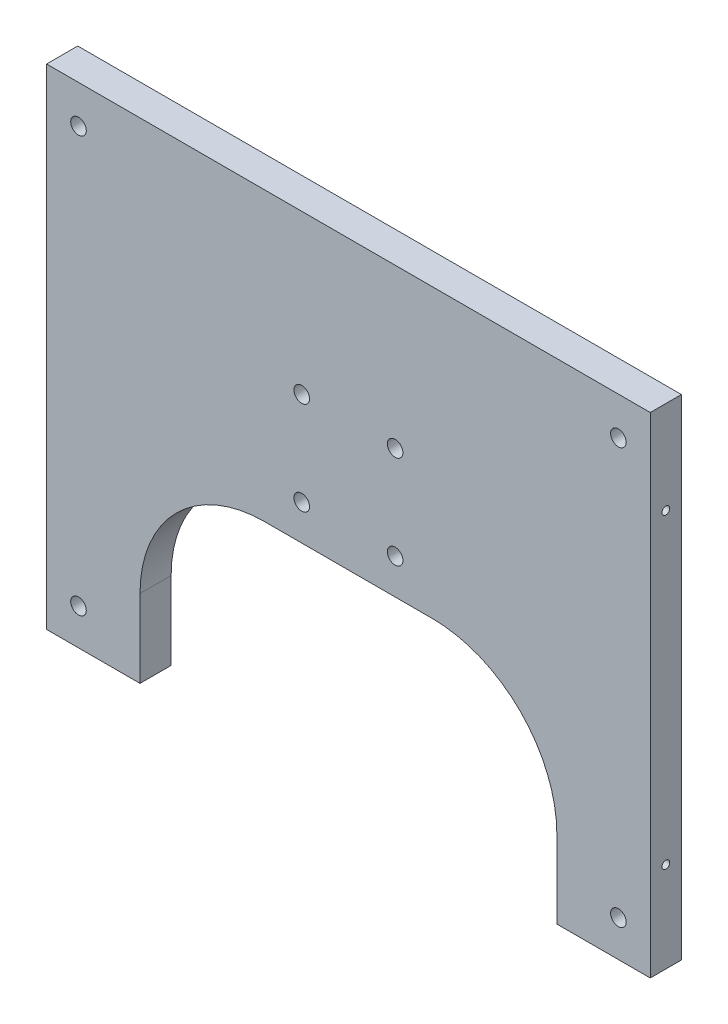
ISO-10303-21;
HEADER;
FILE_DESCRIPTION(('STEP AP214'),'2;1');
FILE_NAME('part.step','',(''),(''),'','','');
FILE_SCHEMA(('AUTOMOTIVE_DESIGN { 1 0 10303 214 1 1 1 1 }'));
ENDSEC;
DATA;
#1=APPLICATION_CONTEXT('core data for automotive mechanical design processes');
#2=APPLICATION_PROTOCOL_DEFINITION('international standard','automotive_design',2000,#1);
#3=PRODUCT_CONTEXT('',#1,'mechanical');
#4=PRODUCT('Part','Part','',(#3));
#5=PRODUCT_RELATED_PRODUCT_CATEGORY('part','',(#4));
#6=PRODUCT_DEFINITION_FORMATION('','',#4);
#7=PRODUCT_DEFINITION_CONTEXT('part definition',#1,'design');
#8=PRODUCT_DEFINITION('design','',#6,#7);
#9=PRODUCT_DEFINITION_SHAPE('','',#8);
#10=(LENGTH_UNIT() NAMED_UNIT(*) SI_UNIT(.MILLI.,.METRE.));
#11=(NAMED_UNIT(*) PLANE_ANGLE_UNIT() SI_UNIT($,.RADIAN.));
#12=(NAMED_UNIT(*) SI_UNIT($,.STERADIAN.) SOLID_ANGLE_UNIT());
#13=UNCERTAINTY_MEASURE_WITH_UNIT(LENGTH_MEASURE(1.E-05),#10,'distance_accuracy_value','');
#14=(GEOMETRIC_REPRESENTATION_CONTEXT(3) GLOBAL_UNCERTAINTY_ASSIGNED_CONTEXT((#13)) GLOBAL_UNIT_ASSIGNED_CONTEXT((#10,
#11,#12)) REPRESENTATION_CONTEXT('',''));
#15=CARTESIAN_POINT('',(0.,0.,0.));
#16=DIRECTION('',(0.,0.,1.));
#17=DIRECTION('',(1.,0.,0.));
#18=AXIS2_PLACEMENT_3D('',#15,#16,#17);
#19=CARTESIAN_POINT('',(12.6999999999998,10.7138543348653,-12.7000000000005));
#20=DIRECTION('',(-1.,0.,0.));
#21=DIRECTION('',(0.,-1.,0.));
#22=AXIS2_PLACEMENT_3D('',#19,#20,#21);
#23=PLANE('',#22);
#24=CARTESIAN_POINT('',(12.6999999999998,-152.193459623223,-6.34999999999336));
#25=DIRECTION('',(-1.,0.,0.));
#26=DIRECTION('',(0.,-1.,0.));
#27=AXIS2_PLACEMENT_3D('',#24,#25,#26);
#28=CIRCLE('',#27,1.58749999999999);
#29=CARTESIAN_POINT('',(12.6999999999998,-153.780959623223,-6.34999999999336));
#30=VERTEX_POINT('',#29);
#31=EDGE_CURVE('E145',#30,#30,#28,.T.);
#32=ORIENTED_EDGE('',*,*,#31,.F.);
#33=EDGE_LOOP('',(#32));
#34=FACE_BOUND('',#33,.T.);
#35=CARTESIAN_POINT('',(12.6999999999998,-27.084945239972,-6.34999999999364));
#36=DIRECTION('',(-1.,0.,0.));
#37=DIRECTION('',(0.,-1.,0.));
#38=AXIS2_PLACEMENT_3D('',#35,#36,#37);
#39=CIRCLE('',#38,1.5875);
#40=CARTESIAN_POINT('',(12.6999999999998,-28.672445239972,-6.34999999999364));
#41=VERTEX_POINT('',#40);
#42=EDGE_CURVE('E149',#41,#41,#39,.T.);
#43=ORIENTED_EDGE('',*,*,#42,.F.);
#44=EDGE_LOOP('',(#43));
#45=FACE_BOUND('',#44,.T.);
#46=DIRECTION('',(0.,-1.,0.));
#47=VECTOR('',#46,1.);
#48=CARTESIAN_POINT('',(12.6999999999995,10.713854334865,-3.33066907387547E-13));
#49=LINE('',#48,#47);
#50=CARTESIAN_POINT('',(12.6999999999995,10.713854334865,-3.33066907387547E-13));
#51=VERTEX_POINT('',#50);
#52=CARTESIAN_POINT('',(12.6999999999996,-189.051843155404,-3.88578058618805E-13));
#53=VERTEX_POINT('',#52);
#54=EDGE_CURVE('E198',#51,#53,#49,.T.);
#55=ORIENTED_EDGE('',*,*,#54,.F.);
#56=DIRECTION('',(0.,0.,1.));
#57=VECTOR('',#56,1.);
#58=CARTESIAN_POINT('',(12.6999999999998,10.7138543348653,-12.7000000000005));
#59=LINE('',#58,#57);
#60=CARTESIAN_POINT('',(12.6999999999998,10.7138543348653,-12.7000000000005));
#61=VERTEX_POINT('',#60);
#62=EDGE_CURVE('E244',#61,#51,#59,.T.);
#63=ORIENTED_EDGE('',*,*,#62,.F.);
#64=DIRECTION('',(0.,-1.,0.));
#65=VECTOR('',#64,1.);
#66=CARTESIAN_POINT('',(12.6999999999998,10.7138543348653,-12.7000000000005));
#67=LINE('',#66,#65);
#68=CARTESIAN_POINT('',(12.6999999999995,-189.051843155405,-12.7000000000003));
#69=VERTEX_POINT('',#68);
#70=EDGE_CURVE('E199',#61,#69,#67,.T.);
#71=ORIENTED_EDGE('',*,*,#70,.T.);
#72=DIRECTION('',(0.,0.,1.));
#73=VECTOR('',#72,1.);
#74=CARTESIAN_POINT('',(12.6999999999995,-189.051843155405,-12.7000000000003));
#75=LINE('',#74,#73);
#76=EDGE_CURVE('E222',#69,#53,#75,.T.);
#77=ORIENTED_EDGE('',*,*,#76,.T.);
#78=EDGE_LOOP('',(#55,#63,#71,#77));
#79=FACE_BOUND('',#78,.T.);
#80=ADVANCED_FACE('F36',(#34,#45,#79),#23,.T.);
#81=CARTESIAN_POINT('',(258.933482757394,10.713854334865,-12.7000000000002));
#82=DIRECTION('',(0.,1.,0.));
#83=DIRECTION('',(-1.,0.,0.));
#84=AXIS2_PLACEMENT_3D('',#81,#82,#83);
#85=PLANE('',#84);
#86=DIRECTION('',(-1.,0.,0.));
#87=VECTOR('',#86,1.);
#88=CARTESIAN_POINT('',(258.933482757394,10.7138543348646,-3.88578058618805E-13));
#89=LINE('',#88,#87);
#90=CARTESIAN_POINT('',(258.933482757394,10.7138543348646,-3.88578058618805E-13));
#91=VERTEX_POINT('',#90);
#92=EDGE_CURVE('E203',#91,#51,#89,.T.);
#93=ORIENTED_EDGE('',*,*,#92,.F.);
#94=DIRECTION('',(0.,0.,1.));
#95=VECTOR('',#94,1.);
#96=CARTESIAN_POINT('',(258.933482757394,10.713854334865,-12.7000000000002));
#97=LINE('',#96,#95);
#98=CARTESIAN_POINT('',(258.933482757394,10.713854334865,-12.7000000000002));
#99=VERTEX_POINT('',#98);
#100=EDGE_CURVE('E247',#99,#91,#97,.T.);
#101=ORIENTED_EDGE('',*,*,#100,.F.);
#102=DIRECTION('',(-1.,0.,0.));
#103=VECTOR('',#102,1.);
#104=CARTESIAN_POINT('',(258.933482757394,10.713854334865,-12.7000000000002));
#105=LINE('',#104,#103);
#106=EDGE_CURVE('E219',#99,#61,#105,.T.);
#107=ORIENTED_EDGE('',*,*,#106,.T.);
#108=ORIENTED_EDGE('',*,*,#62,.T.);
#109=EDGE_LOOP('',(#93,#101,#107,#108));
#110=FACE_BOUND('',#109,.T.);
#111=ADVANCED_FACE('F282',(#110),#85,.T.);
#112=CARTESIAN_POINT('',(258.933482757394,10.713854334865,-12.7000000000002));
#113=DIRECTION('',(1.,0.,0.));
#114=DIRECTION('',(0.,1.,0.));
#115=AXIS2_PLACEMENT_3D('',#112,#113,#114);
#116=PLANE('',#115);
#117=CARTESIAN_POINT('',(258.933482757393,-152.193459623225,-6.34999999999358));
#118=DIRECTION('',(1.,0.,0.));
#119=DIRECTION('',(0.,1.,0.));
#120=AXIS2_PLACEMENT_3D('',#117,#118,#119);
#121=CIRCLE('',#120,1.58749999999999);
#122=CARTESIAN_POINT('',(258.933482757393,-150.605959623225,-6.34999999999358));
#123=VERTEX_POINT('',#122);
#124=EDGE_CURVE('E40',#123,#123,#121,.T.);
#125=ORIENTED_EDGE('',*,*,#124,.F.);
#126=EDGE_LOOP('',(#125));
#127=FACE_BOUND('',#126,.T.);
#128=CARTESIAN_POINT('',(258.933482757394,-27.0849452399722,-6.34999999999331));
#129=DIRECTION('',(1.,0.,0.));
#130=DIRECTION('',(0.,1.,0.));
#131=AXIS2_PLACEMENT_3D('',#128,#129,#130);
#132=CIRCLE('',#131,1.5875);
#133=CARTESIAN_POINT('',(258.933482757394,-25.4974452399722,-6.34999999999331));
#134=VERTEX_POINT('',#133);
#135=EDGE_CURVE('E141',#134,#134,#132,.T.);
#136=ORIENTED_EDGE('',*,*,#135,.F.);
#137=EDGE_LOOP('',(#136));
#138=FACE_BOUND('',#137,.T.);
#139=DIRECTION('',(0.,1.,0.));
#140=VECTOR('',#139,1.);
#141=CARTESIAN_POINT('',(258.933482757394,10.7138543348646,-3.88578058618805E-13));
#142=LINE('',#141,#140);
#143=CARTESIAN_POINT('',(258.933482757393,-189.051843155407,-1.11022302462516E-13));
#144=VERTEX_POINT('',#143);
#145=EDGE_CURVE('E239',#144,#91,#142,.T.);
#146=ORIENTED_EDGE('',*,*,#145,.F.);
#147=DIRECTION('',(0.,0.,1.));
#148=VECTOR('',#147,1.);
#149=CARTESIAN_POINT('',(258.933482757393,-189.051843155409,-12.6999999999999));
#150=LINE('',#149,#148);
#151=CARTESIAN_POINT('',(258.933482757393,-189.051843155409,-12.6999999999999));
#152=VERTEX_POINT('',#151);
#153=EDGE_CURVE('E249',#152,#144,#150,.T.);
#154=ORIENTED_EDGE('',*,*,#153,.F.);
#155=DIRECTION('',(0.,1.,0.));
#156=VECTOR('',#155,1.);
#157=CARTESIAN_POINT('',(258.933482757394,10.713854334865,-12.7000000000002));
#158=LINE('',#157,#156);
#159=EDGE_CURVE('E216',#152,#99,#158,.T.);
#160=ORIENTED_EDGE('',*,*,#159,.T.);
#161=ORIENTED_EDGE('',*,*,#100,.T.);
#162=EDGE_LOOP('',(#146,#154,#160,#161));
#163=FACE_BOUND('',#162,.T.);
#164=ADVANCED_FACE('F278',(#127,#138,#163),#116,.T.);
#165=CARTESIAN_POINT('',(258.933482757393,-189.051843155409,-12.6999999999999));
#166=DIRECTION('',(0.,-1.,0.));
#167=DIRECTION('',(1.,0.,0.));
#168=AXIS2_PLACEMENT_3D('',#165,#166,#167);
#169=PLANE('',#168);
#170=DIRECTION('',(1.,0.,0.));
#171=VECTOR('',#170,1.);
#172=CARTESIAN_POINT('',(258.933482757393,-189.051843155407,-1.11022302462516E-13));
#173=LINE('',#172,#171);
#174=CARTESIAN_POINT('',(220.833482757393,-189.051843155407,1.11022302462516E-13));
#175=VERTEX_POINT('',#174);
#176=EDGE_CURVE('E236',#175,#144,#173,.T.);
#177=ORIENTED_EDGE('',*,*,#176,.F.);
#178=DIRECTION('',(0.,0.,1.));
#179=VECTOR('',#178,1.);
#180=CARTESIAN_POINT('',(220.833482757393,-189.051843155407,-12.6999999999999));
#181=LINE('',#180,#179);
#182=CARTESIAN_POINT('',(220.833482757393,-189.051843155407,-12.6999999999999));
#183=VERTEX_POINT('',#182);
#184=EDGE_CURVE('E251',#183,#175,#181,.T.);
#185=ORIENTED_EDGE('',*,*,#184,.F.);
#186=DIRECTION('',(1.,0.,0.));
#187=VECTOR('',#186,1.);
#188=CARTESIAN_POINT('',(258.933482757393,-189.051843155409,-12.6999999999999));
#189=LINE('',#188,#187);
#190=EDGE_CURVE('E213',#183,#152,#189,.T.);
#191=ORIENTED_EDGE('',*,*,#190,.T.);
#192=ORIENTED_EDGE('',*,*,#153,.T.);
#193=EDGE_LOOP('',(#177,#185,#191,#192));
#194=FACE_BOUND('',#193,.T.);
#195=ADVANCED_FACE('F281',(#194),#169,.T.);
#196=CARTESIAN_POINT('',(220.833482757393,-189.051843155407,-12.6999999999999));
#197=DIRECTION('',(-1.,0.,0.));
#198=DIRECTION('',(0.,-1.,0.));
#199=AXIS2_PLACEMENT_3D('',#196,#197,#198);
#200=PLANE('',#199);
#201=DIRECTION('',(0.,-1.,0.));
#202=VECTOR('',#201,1.);
#203=CARTESIAN_POINT('',(220.833482757393,-189.051843155407,1.11022302462516E-13));
#204=LINE('',#203,#202);
#205=CARTESIAN_POINT('',(220.833482757393,-157.301843155406,-2.77555756156289E-13));
#206=VERTEX_POINT('',#205);
#207=EDGE_CURVE('E234',#206,#175,#204,.T.);
#208=ORIENTED_EDGE('',*,*,#207,.F.);
#209=DIRECTION('',(0.,0.,1.));
#210=VECTOR('',#209,1.);
#211=CARTESIAN_POINT('',(220.833482757394,-157.301843155407,-12.7000000000001));
#212=LINE('',#211,#210);
#213=CARTESIAN_POINT('',(220.833482757394,-157.301843155407,-12.7000000000001));
#214=VERTEX_POINT('',#213);
#215=EDGE_CURVE('E261',#206,#214,#212,.F.);
#216=ORIENTED_EDGE('',*,*,#215,.T.);
#217=DIRECTION('',(0.,-1.,0.));
#218=VECTOR('',#217,1.);
#219=CARTESIAN_POINT('',(220.833482757393,-189.051843155407,-12.6999999999999));
#220=LINE('',#219,#218);
#221=EDGE_CURVE('E211',#214,#183,#220,.T.);
#222=ORIENTED_EDGE('',*,*,#221,.T.);
#223=ORIENTED_EDGE('',*,*,#184,.T.);
#224=EDGE_LOOP('',(#208,#216,#222,#223));
#225=FACE_BOUND('',#224,.T.);
#226=ADVANCED_FACE('F342',(#225),#200,.T.);
#227=CARTESIAN_POINT('',(50.7999999999996,-106.501843155405,-12.7));
#228=DIRECTION('',(0.,-1.,0.));
#229=DIRECTION('',(1.,0.,0.));
#230=AXIS2_PLACEMENT_3D('',#227,#228,#229);
#231=PLANE('',#230);
#232=DIRECTION('',(1.,0.,0.));
#233=VECTOR('',#232,1.);
#234=CARTESIAN_POINT('',(50.7999999999996,-106.501843155405,-12.7));
#235=LINE('',#234,#233);
#236=CARTESIAN_POINT('',(101.6,-106.501843155407,-12.6999999999997));
#237=VERTEX_POINT('',#236);
#238=CARTESIAN_POINT('',(170.033482757394,-106.501843155405,-12.7000000000004));
#239=VERTEX_POINT('',#238);
#240=EDGE_CURVE('E208',#237,#239,#235,.T.);
#241=ORIENTED_EDGE('',*,*,#240,.T.);
#242=DIRECTION('',(0.,0.,1.));
#243=VECTOR('',#242,1.);
#244=CARTESIAN_POINT('',(170.033482757394,-106.501843155406,-6.10622663543836E-13));
#245=LINE('',#244,#243);
#246=CARTESIAN_POINT('',(170.033482757394,-106.501843155406,-6.10622663543836E-13));
#247=VERTEX_POINT('',#246);
#248=EDGE_CURVE('E258',#239,#247,#245,.T.);
#249=ORIENTED_EDGE('',*,*,#248,.T.);
#250=DIRECTION('',(1.,0.,0.));
#251=VECTOR('',#250,1.);
#252=CARTESIAN_POINT('',(50.7999999999996,-106.501843155405,4.44089209850063E-13));
#253=LINE('',#252,#251);
#254=CARTESIAN_POINT('',(101.6,-106.501843155408,3.88578058618805E-13));
#255=VERTEX_POINT('',#254);
#256=EDGE_CURVE('E231',#255,#247,#253,.T.);
#257=ORIENTED_EDGE('',*,*,#256,.F.);
#258=DIRECTION('',(0.,0.,1.));
#259=VECTOR('',#258,1.);
#260=CARTESIAN_POINT('',(101.6,-106.501843155407,-12.6999999999997));
#261=LINE('',#260,#259);
#262=EDGE_CURVE('E246',#255,#237,#261,.F.);
#263=ORIENTED_EDGE('',*,*,#262,.T.);
#264=EDGE_LOOP('',(#241,#249,#257,#263));
#265=FACE_BOUND('',#264,.T.);
#266=ADVANCED_FACE('F312',(#265),#231,.T.);
#267=CARTESIAN_POINT('',(50.7999999999996,-189.051843155405,-12.7000000000003));
#268=DIRECTION('',(1.,0.,0.));
#269=DIRECTION('',(0.,0.,-1.));
#270=AXIS2_PLACEMENT_3D('',#267,#268,#269);
#271=PLANE('',#270);
#272=DIRECTION('',(0.,1.,0.));
#273=VECTOR('',#272,1.);
#274=CARTESIAN_POINT('',(50.7999999999996,-189.051843155405,-12.7000000000003));
#275=LINE('',#274,#273);
#276=CARTESIAN_POINT('',(50.7999999999996,-189.051843155405,-12.7000000000003));
#277=VERTEX_POINT('',#276);
#278=CARTESIAN_POINT('',(50.7999999999996,-157.301843155406,-12.7000000000002));
#279=VERTEX_POINT('',#278);
#280=EDGE_CURVE('E206',#277,#279,#275,.T.);
#281=ORIENTED_EDGE('',*,*,#280,.T.);
#282=DIRECTION('',(0.,0.,1.));
#283=VECTOR('',#282,1.);
#284=CARTESIAN_POINT('',(50.7999999999998,-157.301843155403,-8.88178419700125E-13));
#285=LINE('',#284,#283);
#286=CARTESIAN_POINT('',(50.7999999999998,-157.301843155403,-8.88178419700125E-13));
#287=VERTEX_POINT('',#286);
#288=EDGE_CURVE('E263',#279,#287,#285,.T.);
#289=ORIENTED_EDGE('',*,*,#288,.T.);
#290=DIRECTION('',(0.,1.,0.));
#291=VECTOR('',#290,1.);
#292=CARTESIAN_POINT('',(50.7999999999996,-189.051843155405,-2.22044604925031E-13));
#293=LINE('',#292,#291);
#294=CARTESIAN_POINT('',(50.7999999999996,-189.051843155405,-2.22044604925031E-13));
#295=VERTEX_POINT('',#294);
#296=EDGE_CURVE('E228',#295,#287,#293,.T.);
#297=ORIENTED_EDGE('',*,*,#296,.F.);
#298=DIRECTION('',(0.,0.,1.));
#299=VECTOR('',#298,1.);
#300=CARTESIAN_POINT('',(50.7999999999996,-189.051843155405,-12.7000000000003));
#301=LINE('',#300,#299);
#302=EDGE_CURVE('E254',#277,#295,#301,.T.);
#303=ORIENTED_EDGE('',*,*,#302,.F.);
#304=EDGE_LOOP('',(#281,#289,#297,#303));
#305=FACE_BOUND('',#304,.T.);
#306=ADVANCED_FACE('F309',(#305),#271,.T.);
#307=CARTESIAN_POINT('',(12.6999999999995,-189.051843155405,-12.7000000000003));
#308=DIRECTION('',(0.,-1.,0.));
#309=DIRECTION('',(0.,0.,-1.));
#310=AXIS2_PLACEMENT_3D('',#307,#308,#309);
#311=PLANE('',#310);
#312=DIRECTION('',(1.,0.,0.));
#313=VECTOR('',#312,1.);
#314=CARTESIAN_POINT('',(12.6999999999996,-189.051843155404,-3.88578058618805E-13));
#315=LINE('',#314,#313);
#316=EDGE_CURVE('E225',#53,#295,#315,.T.);
#317=ORIENTED_EDGE('',*,*,#316,.F.);
#318=ORIENTED_EDGE('',*,*,#76,.F.);
#319=DIRECTION('',(1.,0.,0.));
#320=VECTOR('',#319,1.);
#321=CARTESIAN_POINT('',(12.6999999999995,-189.051843155405,-12.7000000000003));
#322=LINE('',#321,#320);
#323=EDGE_CURVE('E202',#69,#277,#322,.T.);
#324=ORIENTED_EDGE('',*,*,#323,.T.);
#325=ORIENTED_EDGE('',*,*,#302,.T.);
#326=EDGE_LOOP('',(#317,#318,#324,#325));
#327=FACE_BOUND('',#326,.T.);
#328=ADVANCED_FACE('F306',(#327),#311,.T.);
#329=CARTESIAN_POINT('',(1.11022302462516E-13,0.,-12.7));
#330=DIRECTION('',(0.,0.,1.));
#331=DIRECTION('',(1.,0.,0.));
#332=AXIS2_PLACEMENT_3D('',#329,#330,#331);
#333=PLANE('',#332);
#334=CARTESIAN_POINT('',(25.7061628891202,-174.233423282268,-12.6999999999998));
#335=DIRECTION('',(0.,0.,-1.));
#336=DIRECTION('',(-1.,0.,0.));
#337=AXIS2_PLACEMENT_3D('',#334,#335,#336);
#338=CIRCLE('',#337,3.175);
#339=CARTESIAN_POINT('',(22.5311628891202,-174.233423282268,-12.6999999999998));
#340=VERTEX_POINT('',#339);
#341=EDGE_CURVE('E150',#340,#340,#338,.T.);
#342=ORIENTED_EDGE('',*,*,#341,.F.);
#343=EDGE_LOOP('',(#342));
#344=FACE_BOUND('',#343,.T.);
#345=CARTESIAN_POINT('',(116.766741378697,-92.0643147285516,-12.7000000000007));
#346=DIRECTION('',(0.,0.,-1.));
#347=DIRECTION('',(-1.,0.,0.));
#348=AXIS2_PLACEMENT_3D('',#345,#346,#347);
#349=CIRCLE('',#348,3.175);
#350=CARTESIAN_POINT('',(113.591741378697,-92.0643147285516,-12.7000000000007));
#351=VERTEX_POINT('',#350);
#352=EDGE_CURVE('E156',#351,#351,#349,.T.);
#353=ORIENTED_EDGE('',*,*,#352,.F.);
#354=EDGE_LOOP('',(#353));
#355=FACE_BOUND('',#354,.T.);
#356=CARTESIAN_POINT('',(154.866741378697,-92.064314728552,-12.7000000000002));
#357=DIRECTION('',(0.,0.,-1.));
#358=DIRECTION('',(-1.,0.,0.));
#359=AXIS2_PLACEMENT_3D('',#356,#357,#358);
#360=CIRCLE('',#359,3.17500000000001);
#361=CARTESIAN_POINT('',(151.691741378697,-92.064314728552,-12.7000000000002));
#362=VERTEX_POINT('',#361);
#363=EDGE_CURVE('E162',#362,#362,#360,.T.);
#364=ORIENTED_EDGE('',*,*,#363,.F.);
#365=EDGE_LOOP('',(#364));
#366=FACE_BOUND('',#365,.T.);
#367=CARTESIAN_POINT('',(245.927319868274,-174.233423282268,-12.6999999999998));
#368=DIRECTION('',(0.,0.,-1.));
#369=DIRECTION('',(-1.,0.,0.));
#370=AXIS2_PLACEMENT_3D('',#367,#368,#369);
#371=CIRCLE('',#370,3.17500000000001);
#372=CARTESIAN_POINT('',(242.752319868274,-174.233423282268,-12.6999999999998));
#373=VERTEX_POINT('',#372);
#374=EDGE_CURVE('E168',#373,#373,#371,.T.);
#375=ORIENTED_EDGE('',*,*,#374,.F.);
#376=EDGE_LOOP('',(#375));
#377=FACE_BOUND('',#376,.T.);
#378=CARTESIAN_POINT('',(154.866741378697,-53.964314728552,-12.7000000000002));
#379=DIRECTION('',(0.,0.,-1.));
#380=DIRECTION('',(-1.,0.,0.));
#381=AXIS2_PLACEMENT_3D('',#378,#379,#380);
#382=CIRCLE('',#381,3.17500000000001);
#383=CARTESIAN_POINT('',(151.691741378697,-53.964314728552,-12.7000000000002));
#384=VERTEX_POINT('',#383);
#385=EDGE_CURVE('E174',#384,#384,#382,.T.);
#386=ORIENTED_EDGE('',*,*,#385,.F.);
#387=EDGE_LOOP('',(#386));
#388=FACE_BOUND('',#387,.T.);
#389=CARTESIAN_POINT('',(245.927319868274,-4.74797050600939,-12.7000000000002));
#390=DIRECTION('',(0.,0.,-1.));
#391=DIRECTION('',(-1.,0.,0.));
#392=AXIS2_PLACEMENT_3D('',#389,#390,#391);
#393=CIRCLE('',#392,3.17500000000001);
#394=CARTESIAN_POINT('',(242.752319868274,-4.74797050600939,-12.7000000000002));
#395=VERTEX_POINT('',#394);
#396=EDGE_CURVE('E180',#395,#395,#393,.T.);
#397=ORIENTED_EDGE('',*,*,#396,.F.);
#398=EDGE_LOOP('',(#397));
#399=FACE_BOUND('',#398,.T.);
#400=CARTESIAN_POINT('',(116.766741378697,-53.964314728552,-12.7000000000009));
#401=DIRECTION('',(0.,0.,-1.));
#402=DIRECTION('',(-1.,0.,0.));
#403=AXIS2_PLACEMENT_3D('',#400,#401,#402);
#404=CIRCLE('',#403,3.175);
#405=CARTESIAN_POINT('',(113.591741378697,-53.964314728552,-12.7000000000009));
#406=VERTEX_POINT('',#405);
#407=EDGE_CURVE('E186',#406,#406,#404,.T.);
#408=ORIENTED_EDGE('',*,*,#407,.F.);
#409=EDGE_LOOP('',(#408));
#410=FACE_BOUND('',#409,.T.);
#411=CARTESIAN_POINT('',(25.7061628891207,-4.74797050600761,-12.7000000000007));
#412=DIRECTION('',(0.,0.,-1.));
#413=DIRECTION('',(-1.,0.,0.));
#414=AXIS2_PLACEMENT_3D('',#411,#412,#413);
#415=CIRCLE('',#414,3.175);
#416=CARTESIAN_POINT('',(22.5311628891207,-4.74797050600761,-12.7000000000007));
#417=VERTEX_POINT('',#416);
#418=EDGE_CURVE('E192',#417,#417,#415,.T.);
#419=ORIENTED_EDGE('',*,*,#418,.F.);
#420=EDGE_LOOP('',(#419));
#421=FACE_BOUND('',#420,.T.);
#422=ORIENTED_EDGE('',*,*,#70,.F.);
#423=ORIENTED_EDGE('',*,*,#106,.F.);
#424=ORIENTED_EDGE('',*,*,#159,.F.);
#425=ORIENTED_EDGE('',*,*,#190,.F.);
#426=ORIENTED_EDGE('',*,*,#221,.F.);
#427=CARTESIAN_POINT('',(170.033482757393,-157.301843155407,-12.7000000000003));
#428=DIRECTION('',(0.,0.,1.));
#429=DIRECTION('',(1.,0.,0.));
#430=AXIS2_PLACEMENT_3D('',#427,#428,#429);
#431=CIRCLE('',#430,50.8);
#432=EDGE_CURVE('E267',#214,#239,#431,.T.);
#433=ORIENTED_EDGE('',*,*,#432,.T.);
#434=ORIENTED_EDGE('',*,*,#240,.F.);
#435=CARTESIAN_POINT('',(101.6,-157.301843155406,-12.6999999999999));
#436=DIRECTION('',(0.,0.,1.));
#437=DIRECTION('',(1.,0.,0.));
#438=AXIS2_PLACEMENT_3D('',#435,#436,#437);
#439=CIRCLE('',#438,50.8);
#440=EDGE_CURVE('E11',#237,#279,#439,.T.);
#441=ORIENTED_EDGE('',*,*,#440,.T.);
#442=ORIENTED_EDGE('',*,*,#280,.F.);
#443=ORIENTED_EDGE('',*,*,#323,.F.);
#444=EDGE_LOOP('',(#422,#423,#424,#425,#426,#433,#434,#441,#442,#443));
#445=FACE_BOUND('',#444,.T.);
#446=ADVANCED_FACE('F297',(#344,#355,#366,#377,#388,#399,#410,#421,#445),#333,.F.);
#447=CARTESIAN_POINT('',(0.,0.,0.));
#448=DIRECTION('',(0.,0.,1.));
#449=DIRECTION('',(1.,0.,0.));
#450=AXIS2_PLACEMENT_3D('',#447,#448,#449);
#451=PLANE('',#450);
#452=CARTESIAN_POINT('',(25.7061628891202,-174.233423282269,0.));
#453=DIRECTION('',(0.,0.,-1.));
#454=DIRECTION('',(-1.,0.,0.));
#455=AXIS2_PLACEMENT_3D('',#452,#453,#454);
#456=CIRCLE('',#455,3.175);
#457=CARTESIAN_POINT('',(22.5311628891202,-174.233423282269,0.));
#458=VERTEX_POINT('',#457);
#459=EDGE_CURVE('E153',#458,#458,#456,.T.);
#460=ORIENTED_EDGE('',*,*,#459,.T.);
#461=EDGE_LOOP('',(#460));
#462=FACE_BOUND('',#461,.T.);
#463=CARTESIAN_POINT('',(116.766741378697,-92.0643147285523,-1.0547118733939E-12));
#464=DIRECTION('',(0.,0.,-1.));
#465=DIRECTION('',(-1.,0.,0.));
#466=AXIS2_PLACEMENT_3D('',#463,#464,#465);
#467=CIRCLE('',#466,3.175);
#468=CARTESIAN_POINT('',(113.591741378697,-92.0643147285523,-1.0547118733939E-12));
#469=VERTEX_POINT('',#468);
#470=EDGE_CURVE('E159',#469,#469,#467,.T.);
#471=ORIENTED_EDGE('',*,*,#470,.T.);
#472=EDGE_LOOP('',(#471));
#473=FACE_BOUND('',#472,.T.);
#474=CARTESIAN_POINT('',(154.866741378697,-92.064314728552,2.77555756156289E-13));
#475=DIRECTION('',(0.,0.,-1.));
#476=DIRECTION('',(-1.,0.,0.));
#477=AXIS2_PLACEMENT_3D('',#474,#475,#476);
#478=CIRCLE('',#477,3.17499999999998);
#479=CARTESIAN_POINT('',(151.691741378697,-92.064314728552,2.77555756156289E-13));
#480=VERTEX_POINT('',#479);
#481=EDGE_CURVE('E165',#480,#480,#478,.T.);
#482=ORIENTED_EDGE('',*,*,#481,.T.);
#483=EDGE_LOOP('',(#482));
#484=FACE_BOUND('',#483,.T.);
#485=CARTESIAN_POINT('',(245.927319868274,-174.233423282269,-7.21644966006352E-13));
#486=DIRECTION('',(0.,0.,-1.));
#487=DIRECTION('',(-1.,0.,0.));
#488=AXIS2_PLACEMENT_3D('',#485,#486,#487);
#489=CIRCLE('',#488,3.17499999999998);
#490=CARTESIAN_POINT('',(242.752319868274,-174.233423282269,-7.21644966006352E-13));
#491=VERTEX_POINT('',#490);
#492=EDGE_CURVE('E171',#491,#491,#489,.T.);
#493=ORIENTED_EDGE('',*,*,#492,.T.);
#494=EDGE_LOOP('',(#493));
#495=FACE_BOUND('',#494,.T.);
#496=CARTESIAN_POINT('',(154.866741378697,-53.964314728552,-2.22044604925031E-13));
#497=DIRECTION('',(0.,0.,-1.));
#498=DIRECTION('',(-1.,0.,0.));
#499=AXIS2_PLACEMENT_3D('',#496,#497,#498);
#500=CIRCLE('',#499,3.17499999999998);
#501=CARTESIAN_POINT('',(151.691741378697,-53.964314728552,-2.22044604925031E-13));
#502=VERTEX_POINT('',#501);
#503=EDGE_CURVE('E177',#502,#502,#500,.T.);
#504=ORIENTED_EDGE('',*,*,#503,.T.);
#505=EDGE_LOOP('',(#504));
#506=FACE_BOUND('',#505,.T.);
#507=CARTESIAN_POINT('',(245.927319868274,-4.74797050600939,-1.11022302462516E-13));
#508=DIRECTION('',(0.,0.,-1.));
#509=DIRECTION('',(-1.,0.,0.));
#510=AXIS2_PLACEMENT_3D('',#507,#508,#509);
#511=CIRCLE('',#510,3.17499999999998);
#512=CARTESIAN_POINT('',(242.752319868274,-4.74797050600939,-1.11022302462516E-13));
#513=VERTEX_POINT('',#512);
#514=EDGE_CURVE('E183',#513,#513,#511,.T.);
#515=ORIENTED_EDGE('',*,*,#514,.T.);
#516=EDGE_LOOP('',(#515));
#517=FACE_BOUND('',#516,.T.);
#518=CARTESIAN_POINT('',(116.766741378697,-53.9643147285511,0.));
#519=DIRECTION('',(0.,0.,-1.));
#520=DIRECTION('',(-1.,0.,0.));
#521=AXIS2_PLACEMENT_3D('',#518,#519,#520);
#522=CIRCLE('',#521,3.175);
#523=CARTESIAN_POINT('',(113.591741378697,-53.9643147285511,0.));
#524=VERTEX_POINT('',#523);
#525=EDGE_CURVE('E189',#524,#524,#522,.T.);
#526=ORIENTED_EDGE('',*,*,#525,.T.);
#527=EDGE_LOOP('',(#526));
#528=FACE_BOUND('',#527,.T.);
#529=CARTESIAN_POINT('',(25.7061628891206,-4.7479705060085,-3.33066907387547E-13));
#530=DIRECTION('',(0.,0.,-1.));
#531=DIRECTION('',(-1.,0.,0.));
#532=AXIS2_PLACEMENT_3D('',#529,#530,#531);
#533=CIRCLE('',#532,3.175);
#534=CARTESIAN_POINT('',(22.5311628891206,-4.7479705060085,-3.33066907387547E-13));
#535=VERTEX_POINT('',#534);
#536=EDGE_CURVE('E195',#535,#535,#533,.T.);
#537=ORIENTED_EDGE('',*,*,#536,.T.);
#538=EDGE_LOOP('',(#537));
#539=FACE_BOUND('',#538,.T.);
#540=ORIENTED_EDGE('',*,*,#54,.T.);
#541=ORIENTED_EDGE('',*,*,#316,.T.);
#542=ORIENTED_EDGE('',*,*,#296,.T.);
#543=CARTESIAN_POINT('',(101.6,-157.301843155405,-3.88578058618805E-13));
#544=DIRECTION('',(0.,0.,1.));
#545=DIRECTION('',(1.,0.,0.));
#546=AXIS2_PLACEMENT_3D('',#543,#544,#545);
#547=CIRCLE('',#546,50.8);
#548=EDGE_CURVE('E45',#287,#255,#547,.F.);
#549=ORIENTED_EDGE('',*,*,#548,.T.);
#550=ORIENTED_EDGE('',*,*,#256,.T.);
#551=CARTESIAN_POINT('',(170.033482757393,-157.301843155407,-3.88578058618805E-13));
#552=DIRECTION('',(0.,0.,1.));
#553=DIRECTION('',(1.,0.,0.));
#554=AXIS2_PLACEMENT_3D('',#551,#552,#553);
#555=CIRCLE('',#554,50.8);
#556=EDGE_CURVE('E265',#247,#206,#555,.F.);
#557=ORIENTED_EDGE('',*,*,#556,.T.);
#558=ORIENTED_EDGE('',*,*,#207,.T.);
#559=ORIENTED_EDGE('',*,*,#176,.T.);
#560=ORIENTED_EDGE('',*,*,#145,.T.);
#561=ORIENTED_EDGE('',*,*,#92,.T.);
#562=EDGE_LOOP('',(#540,#541,#542,#549,#550,#557,#558,#559,#560,#561));
#563=FACE_BOUND('',#562,.T.);
#564=ADVANCED_FACE('F290',(#462,#473,#484,#495,#506,#517,#528,#539,#563),#451,.T.);
#565=CARTESIAN_POINT('',(25.7061628891207,-4.74797050600761,-12.7000000000007));
#566=DIRECTION('',(0.,0.,-1.));
#567=DIRECTION('',(-1.,0.,0.));
#568=AXIS2_PLACEMENT_3D('',#565,#566,#567);
#569=CYLINDRICAL_SURFACE('',#568,3.175);
#570=ORIENTED_EDGE('',*,*,#536,.F.);
#571=EDGE_LOOP('',(#570));
#572=FACE_BOUND('',#571,.T.);
#573=ORIENTED_EDGE('',*,*,#418,.T.);
#574=EDGE_LOOP('',(#573));
#575=FACE_BOUND('',#574,.T.);
#576=ADVANCED_FACE('F350',(#572,#575),#569,.F.);
#577=CARTESIAN_POINT('',(116.766741378697,-53.964314728552,-12.7000000000009));
#578=DIRECTION('',(0.,0.,-1.));
#579=DIRECTION('',(-1.,0.,0.));
#580=AXIS2_PLACEMENT_3D('',#577,#578,#579);
#581=CYLINDRICAL_SURFACE('',#580,3.175);
#582=ORIENTED_EDGE('',*,*,#525,.F.);
#583=EDGE_LOOP('',(#582));
#584=FACE_BOUND('',#583,.T.);
#585=ORIENTED_EDGE('',*,*,#407,.T.);
#586=EDGE_LOOP('',(#585));
#587=FACE_BOUND('',#586,.T.);
#588=ADVANCED_FACE('F357',(#584,#587),#581,.F.);
#589=CARTESIAN_POINT('',(245.927319868274,-4.74797050600939,-12.7000000000002));
#590=DIRECTION('',(0.,0.,-1.));
#591=DIRECTION('',(-1.,0.,0.));
#592=AXIS2_PLACEMENT_3D('',#589,#590,#591);
#593=CYLINDRICAL_SURFACE('',#592,3.175);
#594=ORIENTED_EDGE('',*,*,#514,.F.);
#595=EDGE_LOOP('',(#594));
#596=FACE_BOUND('',#595,.T.);
#597=ORIENTED_EDGE('',*,*,#396,.T.);
#598=EDGE_LOOP('',(#597));
#599=FACE_BOUND('',#598,.T.);
#600=ADVANCED_FACE('F361',(#596,#599),#593,.F.);
#601=CARTESIAN_POINT('',(154.866741378697,-53.964314728552,-12.7000000000002));
#602=DIRECTION('',(0.,0.,-1.));
#603=DIRECTION('',(-1.,0.,0.));
#604=AXIS2_PLACEMENT_3D('',#601,#602,#603);
#605=CYLINDRICAL_SURFACE('',#604,3.175);
#606=ORIENTED_EDGE('',*,*,#503,.F.);
#607=EDGE_LOOP('',(#606));
#608=FACE_BOUND('',#607,.T.);
#609=ORIENTED_EDGE('',*,*,#385,.T.);
#610=EDGE_LOOP('',(#609));
#611=FACE_BOUND('',#610,.T.);
#612=ADVANCED_FACE('F365',(#608,#611),#605,.F.);
#613=CARTESIAN_POINT('',(245.927319868274,-174.233423282268,-12.6999999999998));
#614=DIRECTION('',(0.,0.,-1.));
#615=DIRECTION('',(-1.,0.,0.));
#616=AXIS2_PLACEMENT_3D('',#613,#614,#615);
#617=CYLINDRICAL_SURFACE('',#616,3.175);
#618=ORIENTED_EDGE('',*,*,#492,.F.);
#619=EDGE_LOOP('',(#618));
#620=FACE_BOUND('',#619,.T.);
#621=ORIENTED_EDGE('',*,*,#374,.T.);
#622=EDGE_LOOP('',(#621));
#623=FACE_BOUND('',#622,.T.);
#624=ADVANCED_FACE('F369',(#620,#623),#617,.F.);
#625=CARTESIAN_POINT('',(154.866741378697,-92.064314728552,-12.7000000000002));
#626=DIRECTION('',(0.,0.,-1.));
#627=DIRECTION('',(-1.,0.,0.));
#628=AXIS2_PLACEMENT_3D('',#625,#626,#627);
#629=CYLINDRICAL_SURFACE('',#628,3.175);
#630=ORIENTED_EDGE('',*,*,#481,.F.);
#631=EDGE_LOOP('',(#630));
#632=FACE_BOUND('',#631,.T.);
#633=ORIENTED_EDGE('',*,*,#363,.T.);
#634=EDGE_LOOP('',(#633));
#635=FACE_BOUND('',#634,.T.);
#636=ADVANCED_FACE('F373',(#632,#635),#629,.F.);
#637=CARTESIAN_POINT('',(116.766741378697,-92.0643147285516,-12.7000000000007));
#638=DIRECTION('',(0.,0.,-1.));
#639=DIRECTION('',(-1.,0.,0.));
#640=AXIS2_PLACEMENT_3D('',#637,#638,#639);
#641=CYLINDRICAL_SURFACE('',#640,3.175);
#642=ORIENTED_EDGE('',*,*,#470,.F.);
#643=EDGE_LOOP('',(#642));
#644=FACE_BOUND('',#643,.T.);
#645=ORIENTED_EDGE('',*,*,#352,.T.);
#646=EDGE_LOOP('',(#645));
#647=FACE_BOUND('',#646,.T.);
#648=ADVANCED_FACE('F377',(#644,#647),#641,.F.);
#649=CARTESIAN_POINT('',(25.7061628891202,-174.233423282268,-12.6999999999998));
#650=DIRECTION('',(0.,0.,-1.));
#651=DIRECTION('',(-1.,0.,0.));
#652=AXIS2_PLACEMENT_3D('',#649,#650,#651);
#653=CYLINDRICAL_SURFACE('',#652,3.175);
#654=ORIENTED_EDGE('',*,*,#459,.F.);
#655=EDGE_LOOP('',(#654));
#656=FACE_BOUND('',#655,.T.);
#657=ORIENTED_EDGE('',*,*,#341,.T.);
#658=EDGE_LOOP('',(#657));
#659=FACE_BOUND('',#658,.T.);
#660=ADVANCED_FACE('F324',(#656,#659),#653,.F.);
#661=CARTESIAN_POINT('',(170.033482757393,-157.301843155407,-12.7000000000003));
#662=DIRECTION('',(0.,0.,-1.));
#663=DIRECTION('',(-1.,0.,0.));
#664=AXIS2_PLACEMENT_3D('',#661,#662,#663);
#665=CYLINDRICAL_SURFACE('',#664,50.8);
#666=ORIENTED_EDGE('',*,*,#432,.F.);
#667=ORIENTED_EDGE('',*,*,#215,.F.);
#668=ORIENTED_EDGE('',*,*,#556,.F.);
#669=ORIENTED_EDGE('',*,*,#248,.F.);
#670=EDGE_LOOP('',(#666,#667,#668,#669));
#671=FACE_BOUND('',#670,.T.);
#672=ADVANCED_FACE('F316',(#671),#665,.F.);
#673=CARTESIAN_POINT('',(101.6,-157.301843155406,-12.6999999999999));
#674=DIRECTION('',(0.,0.,-1.));
#675=DIRECTION('',(-1.,0.,0.));
#676=AXIS2_PLACEMENT_3D('',#673,#674,#675);
#677=CYLINDRICAL_SURFACE('',#676,50.8);
#678=ORIENTED_EDGE('',*,*,#440,.F.);
#679=ORIENTED_EDGE('',*,*,#262,.F.);
#680=ORIENTED_EDGE('',*,*,#548,.F.);
#681=ORIENTED_EDGE('',*,*,#288,.F.);
#682=EDGE_LOOP('',(#678,#679,#680,#681));
#683=FACE_BOUND('',#682,.T.);
#684=ADVANCED_FACE('F38',(#683),#677,.F.);
#685=CARTESIAN_POINT('',(38.0999999999941,-27.0849452399717,-6.34999999999342));
#686=DIRECTION('',(-1.,0.,0.));
#687=DIRECTION('',(0.,0.,1.));
#688=AXIS2_PLACEMENT_3D('',#685,#686,#687);
#689=CONICAL_SURFACE('',#688,1.5875,1.02974425867666);
#690=CARTESIAN_POINT('',(39.0538662327004,-27.0849452399717,-6.34999999999342));
#691=VERTEX_POINT('',#690);
#692=VERTEX_LOOP('',#691);
#693=FACE_BOUND('',#692,.T.);
#694=CARTESIAN_POINT('',(38.0999999999941,-27.0849452399717,-6.34999999999342));
#695=DIRECTION('',(-1.,0.,0.));
#696=DIRECTION('',(0.,0.,1.));
#697=AXIS2_PLACEMENT_3D('',#694,#695,#696);
#698=CIRCLE('',#697,1.5875);
#699=CARTESIAN_POINT('',(38.0999999999941,-27.0849452399717,-4.76249999999342));
#700=VERTEX_POINT('',#699);
#701=EDGE_CURVE('E146',#700,#700,#698,.T.);
#702=ORIENTED_EDGE('',*,*,#701,.T.);
#703=EDGE_LOOP('',(#702));
#704=FACE_BOUND('',#703,.T.);
#705=ADVANCED_FACE('F315',(#693,#704),#689,.F.);
#706=CARTESIAN_POINT('',(-6.32827124036339E-12,-27.0849452399715,-6.34999999999364));
#707=DIRECTION('',(-1.,0.,0.));
#708=DIRECTION('',(0.,0.,1.));
#709=AXIS2_PLACEMENT_3D('',#706,#707,#708);
#710=CYLINDRICAL_SURFACE('',#709,1.5875);
#711=ORIENTED_EDGE('',*,*,#42,.T.);
#712=EDGE_LOOP('',(#711));
#713=FACE_BOUND('',#712,.T.);
#714=ORIENTED_EDGE('',*,*,#701,.F.);
#715=EDGE_LOOP('',(#714));
#716=FACE_BOUND('',#715,.T.);
#717=ADVANCED_FACE('F321',(#713,#716),#710,.F.);
#718=CARTESIAN_POINT('',(38.0999999999942,-152.193459623224,-6.34999999999347));
#719=DIRECTION('',(-1.,0.,0.));
#720=DIRECTION('',(0.,0.,1.));
#721=AXIS2_PLACEMENT_3D('',#718,#719,#720);
#722=CONICAL_SURFACE('',#721,1.58749999999999,1.02974425867665);
#723=CARTESIAN_POINT('',(39.0538662327005,-152.193459623224,-6.34999999999347));
#724=VERTEX_POINT('',#723);
#725=VERTEX_LOOP('',#724);
#726=FACE_BOUND('',#725,.T.);
#727=CARTESIAN_POINT('',(38.0999999999942,-152.193459623224,-6.34999999999347));
#728=DIRECTION('',(-1.,0.,0.));
#729=DIRECTION('',(0.,0.,1.));
#730=AXIS2_PLACEMENT_3D('',#727,#728,#729);
#731=CIRCLE('',#730,1.58749999999999);
#732=CARTESIAN_POINT('',(38.0999999999942,-152.193459623224,-4.76249999999348));
#733=VERTEX_POINT('',#732);
#734=EDGE_CURVE('E142',#733,#733,#731,.T.);
#735=ORIENTED_EDGE('',*,*,#734,.T.);
#736=EDGE_LOOP('',(#735));
#737=FACE_BOUND('',#736,.T.);
#738=ADVANCED_FACE('F387',(#726,#737),#722,.F.);
#739=CARTESIAN_POINT('',(-6.32827124036339E-12,-152.193459623224,-6.34999999999381));
#740=DIRECTION('',(-1.,0.,0.));
#741=DIRECTION('',(0.,0.,1.));
#742=AXIS2_PLACEMENT_3D('',#739,#740,#741);
#743=CYLINDRICAL_SURFACE('',#742,1.58749999999999);
#744=ORIENTED_EDGE('',*,*,#31,.T.);
#745=EDGE_LOOP('',(#744));
#746=FACE_BOUND('',#745,.T.);
#747=ORIENTED_EDGE('',*,*,#734,.F.);
#748=EDGE_LOOP('',(#747));
#749=FACE_BOUND('',#748,.T.);
#750=ADVANCED_FACE('F391',(#746,#749),#743,.F.);
#751=CARTESIAN_POINT('',(233.5334827574,-27.0849452399726,-6.34999999999308));
#752=DIRECTION('',(1.,0.,0.));
#753=DIRECTION('',(0.,0.,-1.));
#754=AXIS2_PLACEMENT_3D('',#751,#752,#753);
#755=CONICAL_SURFACE('',#754,1.5875,1.02974425867666);
#756=CARTESIAN_POINT('',(232.579616524694,-27.0849452399726,-6.34999999999308));
#757=VERTEX_POINT('',#756);
#758=VERTEX_LOOP('',#757);
#759=FACE_BOUND('',#758,.T.);
#760=CARTESIAN_POINT('',(233.5334827574,-27.0849452399726,-6.34999999999308));
#761=DIRECTION('',(1.,0.,0.));
#762=DIRECTION('',(0.,0.,-1.));
#763=AXIS2_PLACEMENT_3D('',#760,#761,#762);
#764=CIRCLE('',#763,1.5875);
#765=CARTESIAN_POINT('',(233.5334827574,-27.0849452399726,-7.93749999999308));
#766=VERTEX_POINT('',#765);
#767=EDGE_CURVE('E137',#766,#766,#764,.T.);
#768=ORIENTED_EDGE('',*,*,#767,.T.);
#769=EDGE_LOOP('',(#768));
#770=FACE_BOUND('',#769,.T.);
#771=ADVANCED_FACE('F395',(#759,#770),#755,.F.);
#772=CARTESIAN_POINT('',(271.633482757399,-27.084945239972,-6.34999999999319));
#773=DIRECTION('',(1.,0.,0.));
#774=DIRECTION('',(0.,0.,-1.));
#775=AXIS2_PLACEMENT_3D('',#772,#773,#774);
#776=CYLINDRICAL_SURFACE('',#775,1.5875);
#777=ORIENTED_EDGE('',*,*,#135,.T.);
#778=EDGE_LOOP('',(#777));
#779=FACE_BOUND('',#778,.T.);
#780=ORIENTED_EDGE('',*,*,#767,.F.);
#781=EDGE_LOOP('',(#780));
#782=FACE_BOUND('',#781,.T.);
#783=ADVANCED_FACE('F129',(#779,#782),#776,.F.);
#784=CARTESIAN_POINT('',(233.533482757399,-152.193459623225,-6.34999999999347));
#785=DIRECTION('',(1.,0.,0.));
#786=DIRECTION('',(0.,0.,-1.));
#787=AXIS2_PLACEMENT_3D('',#784,#785,#786);
#788=CONICAL_SURFACE('',#787,1.58749999999999,1.02974425867666);
#789=CARTESIAN_POINT('',(232.579616524693,-152.193459623225,-6.34999999999347));
#790=VERTEX_POINT('',#789);
#791=VERTEX_LOOP('',#790);
#792=FACE_BOUND('',#791,.T.);
#793=CARTESIAN_POINT('',(233.533482757399,-152.193459623225,-6.34999999999347));
#794=DIRECTION('',(1.,0.,0.));
#795=DIRECTION('',(0.,0.,-1.));
#796=AXIS2_PLACEMENT_3D('',#793,#794,#795);
#797=CIRCLE('',#796,1.58749999999999);
#798=CARTESIAN_POINT('',(233.533482757399,-152.193459623225,-7.93749999999346));
#799=VERTEX_POINT('',#798);
#800=EDGE_CURVE('E133',#799,#799,#797,.T.);
#801=ORIENTED_EDGE('',*,*,#800,.T.);
#802=EDGE_LOOP('',(#801));
#803=FACE_BOUND('',#802,.T.);
#804=ADVANCED_FACE('F125',(#792,#803),#788,.F.);
#805=CARTESIAN_POINT('',(271.633482757399,-152.193459623225,-6.34999999999364));
#806=DIRECTION('',(1.,0.,0.));
#807=DIRECTION('',(0.,0.,-1.));
#808=AXIS2_PLACEMENT_3D('',#805,#806,#807);
#809=CYLINDRICAL_SURFACE('',#808,1.58749999999999);
#810=ORIENTED_EDGE('',*,*,#124,.T.);
#811=EDGE_LOOP('',(#810));
#812=FACE_BOUND('',#811,.T.);
#813=ORIENTED_EDGE('',*,*,#800,.F.);
#814=EDGE_LOOP('',(#813));
#815=FACE_BOUND('',#814,.T.);
#816=ADVANCED_FACE('F128',(#812,#815),#809,.F.);
#817=CLOSED_SHELL('',(#80,#111,#164,#195,#226,#266,#306,#328,#446,#564,#576,#588,#600,#612,#624,
#636,#648,#660,#672,#684,#705,#717,#738,#750,#771,#783,#804,#816));
#818=MANIFOLD_SOLID_BREP('B2',#817);
#819=ADVANCED_BREP_SHAPE_REPRESENTATION('',(#18,#818),#14);
#820=SHAPE_DEFINITION_REPRESENTATION(#9,#819);
ENDSEC;
END-ISO-10303-21;
